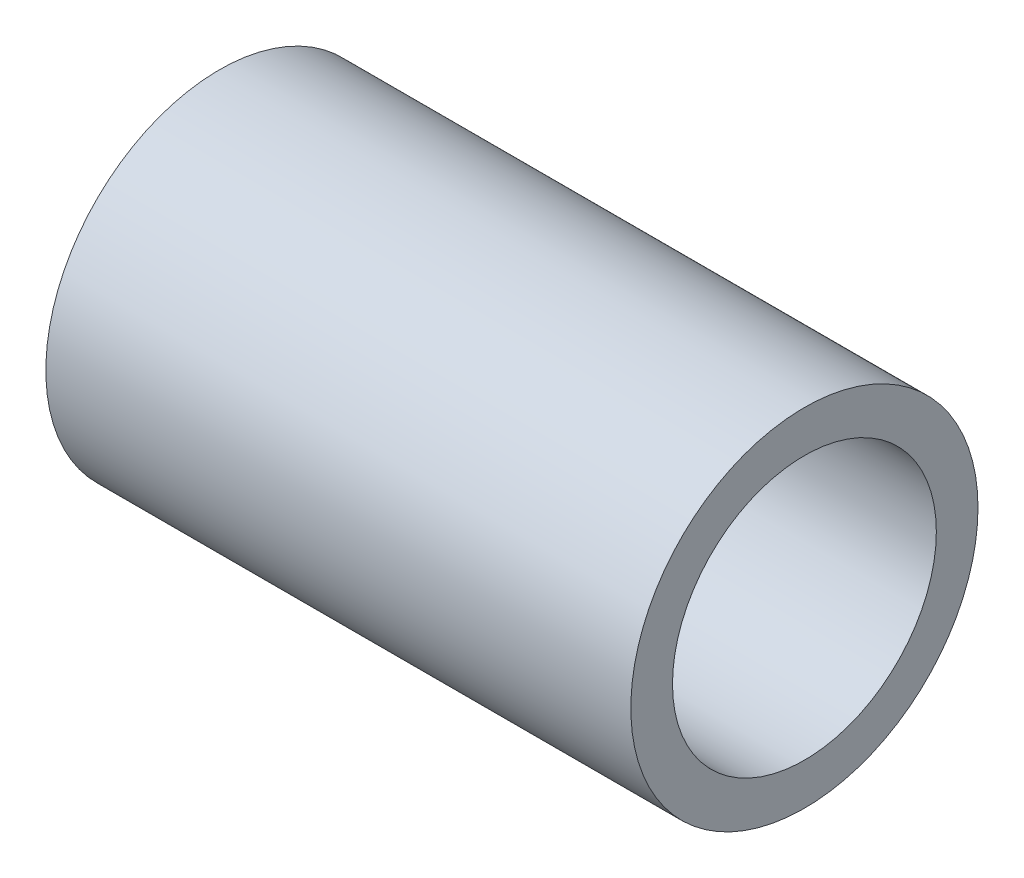
ISO-10303-21;
HEADER;
FILE_DESCRIPTION(('STEP AP214'),'2;1');
FILE_NAME('part.step','',(''),(''),'','','');
FILE_SCHEMA(('AUTOMOTIVE_DESIGN { 1 0 10303 214 1 1 1 1 }'));
ENDSEC;
DATA;
#1=APPLICATION_CONTEXT('core data for automotive mechanical design processes');
#2=APPLICATION_PROTOCOL_DEFINITION('international standard','automotive_design',2000,#1);
#3=PRODUCT_CONTEXT('',#1,'mechanical');
#4=PRODUCT('Part','Part','',(#3));
#5=PRODUCT_RELATED_PRODUCT_CATEGORY('part','',(#4));
#6=PRODUCT_DEFINITION_FORMATION('','',#4);
#7=PRODUCT_DEFINITION_CONTEXT('part definition',#1,'design');
#8=PRODUCT_DEFINITION('design','',#6,#7);
#9=PRODUCT_DEFINITION_SHAPE('','',#8);
#10=(LENGTH_UNIT() NAMED_UNIT(*) SI_UNIT(.MILLI.,.METRE.));
#11=(NAMED_UNIT(*) PLANE_ANGLE_UNIT() SI_UNIT($,.RADIAN.));
#12=(NAMED_UNIT(*) SI_UNIT($,.STERADIAN.) SOLID_ANGLE_UNIT());
#13=UNCERTAINTY_MEASURE_WITH_UNIT(LENGTH_MEASURE(1.E-05),#10,'distance_accuracy_value','');
#14=(GEOMETRIC_REPRESENTATION_CONTEXT(3) GLOBAL_UNCERTAINTY_ASSIGNED_CONTEXT((#13)) GLOBAL_UNIT_ASSIGNED_CONTEXT((#10,
#11,#12)) REPRESENTATION_CONTEXT('',''));
#15=CARTESIAN_POINT('',(0.,0.,0.));
#16=DIRECTION('',(0.,0.,1.));
#17=DIRECTION('',(1.,0.,0.));
#18=AXIS2_PLACEMENT_3D('',#15,#16,#17);
#19=CARTESIAN_POINT('',(21.3995,0.,0.));
#20=DIRECTION('',(1.,0.,0.));
#21=DIRECTION('',(0.,0.,-1.));
#22=AXIS2_PLACEMENT_3D('',#19,#20,#21);
#23=PLANE('',#22);
#24=CARTESIAN_POINT('',(21.3995,0.,0.));
#25=DIRECTION('',(1.,0.,0.));
#26=DIRECTION('',(0.,0.,-1.));
#27=AXIS2_PLACEMENT_3D('',#24,#25,#26);
#28=CIRCLE('',#27,6.35);
#29=CARTESIAN_POINT('',(21.3995,0.,-6.35));
#30=VERTEX_POINT('',#29);
#31=EDGE_CURVE('E10',#30,#30,#28,.T.);
#32=ORIENTED_EDGE('',*,*,#31,.T.);
#33=EDGE_LOOP('',(#32));
#34=FACE_BOUND('',#33,.T.);
#35=CARTESIAN_POINT('',(21.3995,0.,0.));
#36=DIRECTION('',(1.,0.,0.));
#37=DIRECTION('',(0.,0.,-1.));
#38=AXIS2_PLACEMENT_3D('',#35,#36,#37);
#39=CIRCLE('',#38,4.826);
#40=CARTESIAN_POINT('',(21.3995,0.,-4.826));
#41=VERTEX_POINT('',#40);
#42=EDGE_CURVE('E41',#41,#41,#39,.T.);
#43=ORIENTED_EDGE('',*,*,#42,.F.);
#44=EDGE_LOOP('',(#43));
#45=FACE_BOUND('',#44,.T.);
#46=ADVANCED_FACE('F30',(#34,#45),#23,.T.);
#47=CARTESIAN_POINT('',(0.,0.,0.));
#48=DIRECTION('',(1.,0.,0.));
#49=DIRECTION('',(0.,0.,-1.));
#50=AXIS2_PLACEMENT_3D('',#47,#48,#49);
#51=PLANE('',#50);
#52=CARTESIAN_POINT('',(0.,0.,0.));
#53=DIRECTION('',(1.,0.,0.));
#54=DIRECTION('',(0.,0.,-1.));
#55=AXIS2_PLACEMENT_3D('',#52,#53,#54);
#56=CIRCLE('',#55,6.35);
#57=CARTESIAN_POINT('',(0.,0.,-6.35));
#58=VERTEX_POINT('',#57);
#59=EDGE_CURVE('E34',#58,#58,#56,.T.);
#60=ORIENTED_EDGE('',*,*,#59,.F.);
#61=EDGE_LOOP('',(#60));
#62=FACE_BOUND('',#61,.T.);
#63=CARTESIAN_POINT('',(0.,0.,0.));
#64=DIRECTION('',(1.,0.,0.));
#65=DIRECTION('',(0.,0.,-1.));
#66=AXIS2_PLACEMENT_3D('',#63,#64,#65);
#67=CIRCLE('',#66,4.826);
#68=CARTESIAN_POINT('',(0.,0.,-4.826));
#69=VERTEX_POINT('',#68);
#70=EDGE_CURVE('E43',#69,#69,#67,.T.);
#71=ORIENTED_EDGE('',*,*,#70,.T.);
#72=EDGE_LOOP('',(#71));
#73=FACE_BOUND('',#72,.T.);
#74=ADVANCED_FACE('F53',(#62,#73),#51,.F.);
#75=CARTESIAN_POINT('',(21.3995,0.,0.));
#76=DIRECTION('',(-1.,0.,0.));
#77=DIRECTION('',(0.,0.,1.));
#78=AXIS2_PLACEMENT_3D('',#75,#76,#77);
#79=CYLINDRICAL_SURFACE('',#78,6.35);
#80=ORIENTED_EDGE('',*,*,#31,.F.);
#81=EDGE_LOOP('',(#80));
#82=FACE_BOUND('',#81,.T.);
#83=ORIENTED_EDGE('',*,*,#59,.T.);
#84=EDGE_LOOP('',(#83));
#85=FACE_BOUND('',#84,.T.);
#86=ADVANCED_FACE('F32',(#82,#85),#79,.T.);
#87=CARTESIAN_POINT('',(21.3995,0.,0.));
#88=DIRECTION('',(-1.,0.,0.));
#89=DIRECTION('',(0.,0.,1.));
#90=AXIS2_PLACEMENT_3D('',#87,#88,#89);
#91=CYLINDRICAL_SURFACE('',#90,4.826);
#92=ORIENTED_EDGE('',*,*,#42,.T.);
#93=EDGE_LOOP('',(#92));
#94=FACE_BOUND('',#93,.T.);
#95=ORIENTED_EDGE('',*,*,#70,.F.);
#96=EDGE_LOOP('',(#95));
#97=FACE_BOUND('',#96,.T.);
#98=ADVANCED_FACE('F49',(#94,#97),#91,.F.);
#99=CLOSED_SHELL('',(#46,#74,#86,#98));
#100=MANIFOLD_SOLID_BREP('B2',#99);
#101=ADVANCED_BREP_SHAPE_REPRESENTATION('',(#18,#100),#14);
#102=SHAPE_DEFINITION_REPRESENTATION(#9,#101);
ENDSEC;
END-ISO-10303-21;
